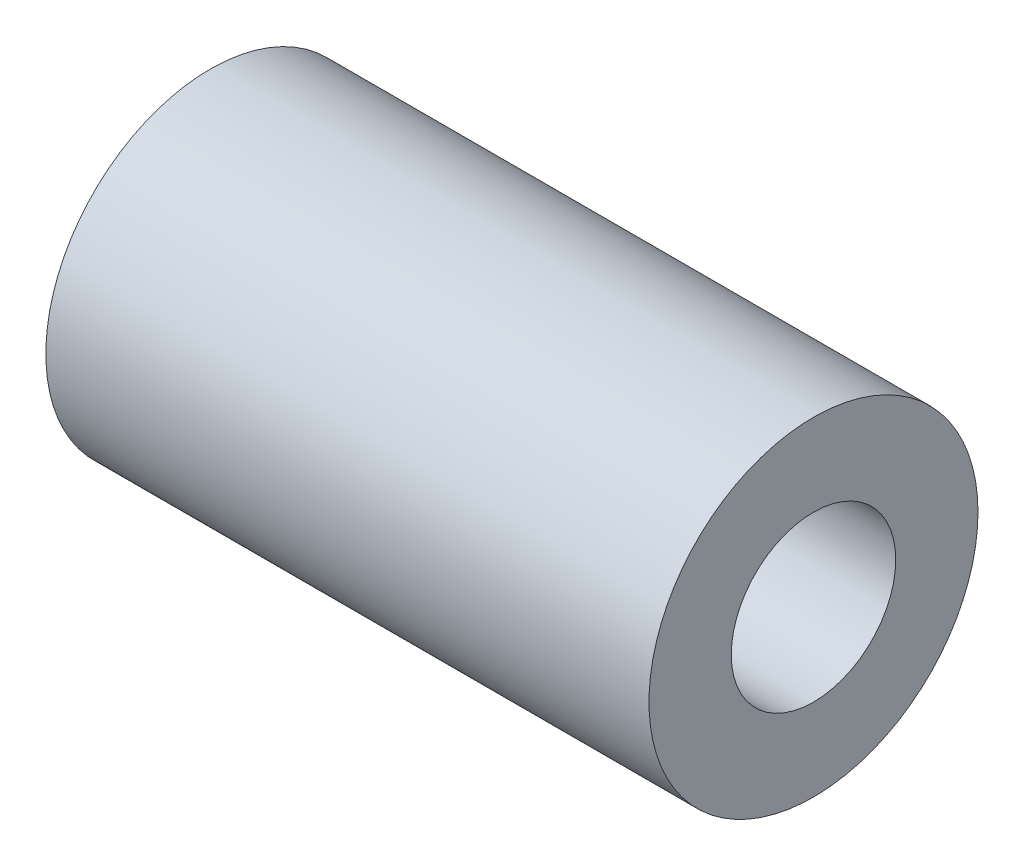
ISO-10303-21;
HEADER;
FILE_DESCRIPTION(('STEP AP214'),'2;1');
FILE_NAME('part.step','',(''),(''),'','','');
FILE_SCHEMA(('AUTOMOTIVE_DESIGN { 1 0 10303 214 1 1 1 1 }'));
ENDSEC;
DATA;
#1=APPLICATION_CONTEXT('core data for automotive mechanical design processes');
#2=APPLICATION_PROTOCOL_DEFINITION('international standard','automotive_design',2000,#1);
#3=PRODUCT_CONTEXT('',#1,'mechanical');
#4=PRODUCT('Part','Part','',(#3));
#5=PRODUCT_RELATED_PRODUCT_CATEGORY('part','',(#4));
#6=PRODUCT_DEFINITION_FORMATION('','',#4);
#7=PRODUCT_DEFINITION_CONTEXT('part definition',#1,'design');
#8=PRODUCT_DEFINITION('design','',#6,#7);
#9=PRODUCT_DEFINITION_SHAPE('','',#8);
#10=(LENGTH_UNIT() NAMED_UNIT(*) SI_UNIT(.MILLI.,.METRE.));
#11=(NAMED_UNIT(*) PLANE_ANGLE_UNIT() SI_UNIT($,.RADIAN.));
#12=(NAMED_UNIT(*) SI_UNIT($,.STERADIAN.) SOLID_ANGLE_UNIT());
#13=UNCERTAINTY_MEASURE_WITH_UNIT(LENGTH_MEASURE(1.E-05),#10,'distance_accuracy_value','');
#14=(GEOMETRIC_REPRESENTATION_CONTEXT(3) GLOBAL_UNCERTAINTY_ASSIGNED_CONTEXT((#13)) GLOBAL_UNIT_ASSIGNED_CONTEXT((#10,
#11,#12)) REPRESENTATION_CONTEXT('',''));
#15=CARTESIAN_POINT('',(0.,0.,0.));
#16=DIRECTION('',(0.,0.,1.));
#17=DIRECTION('',(1.,0.,0.));
#18=AXIS2_PLACEMENT_3D('',#15,#16,#17);
#19=CARTESIAN_POINT('',(34.925,0.,0.));
#20=DIRECTION('',(1.,0.,0.));
#21=DIRECTION('',(0.,0.,-1.));
#22=AXIS2_PLACEMENT_3D('',#19,#20,#21);
#23=PLANE('',#22);
#24=CARTESIAN_POINT('',(34.925,0.,0.));
#25=DIRECTION('',(1.,0.,0.));
#26=DIRECTION('',(0.,0.,-1.));
#27=AXIS2_PLACEMENT_3D('',#24,#25,#26);
#28=CIRCLE('',#27,9.525);
#29=CARTESIAN_POINT('',(34.925,0.,-9.525));
#30=VERTEX_POINT('',#29);
#31=EDGE_CURVE('E10',#30,#30,#28,.T.);
#32=ORIENTED_EDGE('',*,*,#31,.T.);
#33=EDGE_LOOP('',(#32));
#34=FACE_BOUND('',#33,.T.);
#35=CARTESIAN_POINT('',(34.925,0.,0.));
#36=DIRECTION('',(1.,0.,0.));
#37=DIRECTION('',(0.,0.,-1.));
#38=AXIS2_PLACEMENT_3D('',#35,#36,#37);
#39=CIRCLE('',#38,4.7625);
#40=CARTESIAN_POINT('',(34.925,0.,-4.7625));
#41=VERTEX_POINT('',#40);
#42=EDGE_CURVE('E42',#41,#41,#39,.T.);
#43=ORIENTED_EDGE('',*,*,#42,.F.);
#44=EDGE_LOOP('',(#43));
#45=FACE_BOUND('',#44,.T.);
#46=ADVANCED_FACE('F31',(#34,#45),#23,.T.);
#47=CARTESIAN_POINT('',(0.,0.,0.));
#48=DIRECTION('',(1.,0.,0.));
#49=DIRECTION('',(0.,0.,-1.));
#50=AXIS2_PLACEMENT_3D('',#47,#48,#49);
#51=PLANE('',#50);
#52=CARTESIAN_POINT('',(0.,0.,0.));
#53=DIRECTION('',(1.,0.,0.));
#54=DIRECTION('',(0.,0.,-1.));
#55=AXIS2_PLACEMENT_3D('',#52,#53,#54);
#56=CIRCLE('',#55,9.525);
#57=CARTESIAN_POINT('',(0.,0.,-9.525));
#58=VERTEX_POINT('',#57);
#59=EDGE_CURVE('E35',#58,#58,#56,.T.);
#60=ORIENTED_EDGE('',*,*,#59,.F.);
#61=EDGE_LOOP('',(#60));
#62=FACE_BOUND('',#61,.T.);
#63=CARTESIAN_POINT('',(0.,0.,0.));
#64=DIRECTION('',(1.,0.,0.));
#65=DIRECTION('',(0.,0.,-1.));
#66=AXIS2_PLACEMENT_3D('',#63,#64,#65);
#67=CIRCLE('',#66,4.7625);
#68=CARTESIAN_POINT('',(0.,0.,-4.7625));
#69=VERTEX_POINT('',#68);
#70=EDGE_CURVE('E44',#69,#69,#67,.T.);
#71=ORIENTED_EDGE('',*,*,#70,.T.);
#72=EDGE_LOOP('',(#71));
#73=FACE_BOUND('',#72,.T.);
#74=ADVANCED_FACE('F54',(#62,#73),#51,.F.);
#75=CARTESIAN_POINT('',(34.925,0.,0.));
#76=DIRECTION('',(-1.,0.,0.));
#77=DIRECTION('',(0.,0.,1.));
#78=AXIS2_PLACEMENT_3D('',#75,#76,#77);
#79=CYLINDRICAL_SURFACE('',#78,9.525);
#80=ORIENTED_EDGE('',*,*,#31,.F.);
#81=EDGE_LOOP('',(#80));
#82=FACE_BOUND('',#81,.T.);
#83=ORIENTED_EDGE('',*,*,#59,.T.);
#84=EDGE_LOOP('',(#83));
#85=FACE_BOUND('',#84,.T.);
#86=ADVANCED_FACE('F33',(#82,#85),#79,.T.);
#87=CARTESIAN_POINT('',(34.925,0.,0.));
#88=DIRECTION('',(-1.,0.,0.));
#89=DIRECTION('',(0.,0.,1.));
#90=AXIS2_PLACEMENT_3D('',#87,#88,#89);
#91=CYLINDRICAL_SURFACE('',#90,4.7625);
#92=ORIENTED_EDGE('',*,*,#42,.T.);
#93=EDGE_LOOP('',(#92));
#94=FACE_BOUND('',#93,.T.);
#95=ORIENTED_EDGE('',*,*,#70,.F.);
#96=EDGE_LOOP('',(#95));
#97=FACE_BOUND('',#96,.T.);
#98=ADVANCED_FACE('F50',(#94,#97),#91,.F.);
#99=CLOSED_SHELL('',(#46,#74,#86,#98));
#100=MANIFOLD_SOLID_BREP('B2',#99);
#101=ADVANCED_BREP_SHAPE_REPRESENTATION('',(#18,#100),#14);
#102=SHAPE_DEFINITION_REPRESENTATION(#9,#101);
ENDSEC;
END-ISO-10303-21;
